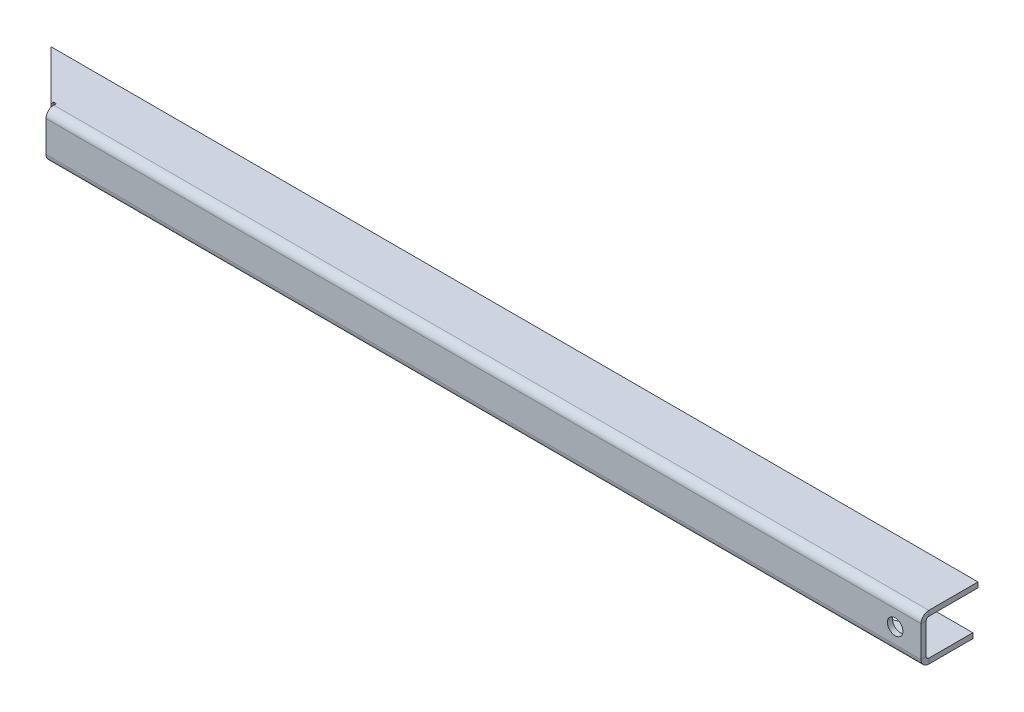
ISO-10303-21;
HEADER;
FILE_DESCRIPTION(('STEP AP214'),'2;1');
FILE_NAME('part.step','',(''),(''),'','','');
FILE_SCHEMA(('AUTOMOTIVE_DESIGN { 1 0 10303 214 1 1 1 1 }'));
ENDSEC;
DATA;
#1=APPLICATION_CONTEXT('core data for automotive mechanical design processes');
#2=APPLICATION_PROTOCOL_DEFINITION('international standard','automotive_design',2000,#1);
#3=PRODUCT_CONTEXT('',#1,'mechanical');
#4=PRODUCT('Part','Part','',(#3));
#5=PRODUCT_RELATED_PRODUCT_CATEGORY('part','',(#4));
#6=PRODUCT_DEFINITION_FORMATION('','',#4);
#7=PRODUCT_DEFINITION_CONTEXT('part definition',#1,'design');
#8=PRODUCT_DEFINITION('design','',#6,#7);
#9=PRODUCT_DEFINITION_SHAPE('','',#8);
#10=(LENGTH_UNIT() NAMED_UNIT(*) SI_UNIT(.MILLI.,.METRE.));
#11=(NAMED_UNIT(*) PLANE_ANGLE_UNIT() SI_UNIT($,.RADIAN.));
#12=(NAMED_UNIT(*) SI_UNIT($,.STERADIAN.) SOLID_ANGLE_UNIT());
#13=UNCERTAINTY_MEASURE_WITH_UNIT(LENGTH_MEASURE(1.E-05),#10,'distance_accuracy_value','');
#14=(GEOMETRIC_REPRESENTATION_CONTEXT(3) GLOBAL_UNCERTAINTY_ASSIGNED_CONTEXT((#13)) GLOBAL_UNIT_ASSIGNED_CONTEXT((#10,
#11,#12)) REPRESENTATION_CONTEXT('',''));
#15=CARTESIAN_POINT('',(0.,0.,0.));
#16=DIRECTION('',(0.,0.,1.));
#17=DIRECTION('',(1.,0.,0.));
#18=AXIS2_PLACEMENT_3D('',#15,#16,#17);
#19=CARTESIAN_POINT('',(-84.5,-8.,1.00000000000002));
#20=DIRECTION('',(1.,0.,0.));
#21=DIRECTION('',(0.,0.,-1.));
#22=AXIS2_PLACEMENT_3D('',#19,#20,#21);
#23=PLANE('',#22);
#24=DIRECTION('',(0.,0.,1.));
#25=VECTOR('',#24,1.);
#26=CARTESIAN_POINT('',(-84.5,-7.50000000000001,0.));
#27=LINE('',#26,#25);
#28=CARTESIAN_POINT('',(-84.5,-7.50000000000001,0.));
#29=VERTEX_POINT('',#28);
#30=CARTESIAN_POINT('',(-84.5,-7.5,1.00000000000003));
#31=VERTEX_POINT('',#30);
#32=EDGE_CURVE('E208',#29,#31,#27,.T.);
#33=ORIENTED_EDGE('',*,*,#32,.T.);
#34=DIRECTION('',(0.,-1.,0.));
#35=VECTOR('',#34,1.);
#36=CARTESIAN_POINT('',(-84.5,-8.,1.00000000000002));
#37=LINE('',#36,#35);
#38=CARTESIAN_POINT('',(-84.5,-1.50000000000001,0.999999999999986));
#39=VERTEX_POINT('',#38);
#40=EDGE_CURVE('E231',#39,#31,#37,.T.);
#41=ORIENTED_EDGE('',*,*,#40,.F.);
#42=DIRECTION('',(0.,0.,1.));
#43=VECTOR('',#42,1.);
#44=CARTESIAN_POINT('',(-84.5,-1.50000000000001,0.));
#45=LINE('',#44,#43);
#46=CARTESIAN_POINT('',(-84.5,-1.5,0.));
#47=VERTEX_POINT('',#46);
#48=EDGE_CURVE('E222',#47,#39,#45,.T.);
#49=ORIENTED_EDGE('',*,*,#48,.F.);
#50=DIRECTION('',(0.,-1.,0.));
#51=VECTOR('',#50,1.);
#52=CARTESIAN_POINT('',(-84.5,-8.,0.));
#53=LINE('',#52,#51);
#54=EDGE_CURVE('E230',#47,#29,#53,.T.);
#55=ORIENTED_EDGE('',*,*,#54,.T.);
#56=EDGE_LOOP('',(#33,#41,#49,#55));
#57=FACE_BOUND('',#56,.T.);
#58=ADVANCED_FACE('F43',(#57),#23,.F.);
#59=CARTESIAN_POINT('',(84.5,-0.999999999999997,0.999999999999969));
#60=DIRECTION('',(-1.,0.,0.));
#61=DIRECTION('',(0.,0.,1.));
#62=AXIS2_PLACEMENT_3D('',#59,#60,#61);
#63=PLANE('',#62);
#64=DIRECTION('',(0.,0.,1.));
#65=VECTOR('',#64,1.);
#66=CARTESIAN_POINT('',(84.5,-7.50000000000001,0.));
#67=LINE('',#66,#65);
#68=CARTESIAN_POINT('',(84.5,-7.50000000000001,0.));
#69=VERTEX_POINT('',#68);
#70=CARTESIAN_POINT('',(84.5,-7.50000000000001,0.999999999999993));
#71=VERTEX_POINT('',#70);
#72=EDGE_CURVE('E214',#69,#71,#67,.T.);
#73=ORIENTED_EDGE('',*,*,#72,.F.);
#74=DIRECTION('',(0.,1.,0.));
#75=VECTOR('',#74,1.);
#76=CARTESIAN_POINT('',(84.5,-1.,0.));
#77=LINE('',#76,#75);
#78=CARTESIAN_POINT('',(84.5,-1.5,0.));
#79=VERTEX_POINT('',#78);
#80=EDGE_CURVE('E234',#69,#79,#77,.T.);
#81=ORIENTED_EDGE('',*,*,#80,.T.);
#82=DIRECTION('',(0.,0.,1.));
#83=VECTOR('',#82,1.);
#84=CARTESIAN_POINT('',(84.5,-1.5,0.));
#85=LINE('',#84,#83);
#86=CARTESIAN_POINT('',(84.5,-1.5,0.999999999999971));
#87=VERTEX_POINT('',#86);
#88=EDGE_CURVE('E217',#79,#87,#85,.T.);
#89=ORIENTED_EDGE('',*,*,#88,.T.);
#90=DIRECTION('',(0.,1.,0.));
#91=VECTOR('',#90,1.);
#92=CARTESIAN_POINT('',(84.5,-0.999999999999997,0.999999999999969));
#93=LINE('',#92,#91);
#94=EDGE_CURVE('E233',#71,#87,#93,.T.);
#95=ORIENTED_EDGE('',*,*,#94,.F.);
#96=EDGE_LOOP('',(#73,#81,#89,#95));
#97=FACE_BOUND('',#96,.T.);
#98=ADVANCED_FACE('F348',(#97),#63,.F.);
#99=CARTESIAN_POINT('',(0.,0.,0.999999999999981));
#100=DIRECTION('',(0.,0.,-1.));
#101=DIRECTION('',(0.,1.,0.));
#102=AXIS2_PLACEMENT_3D('',#99,#100,#101);
#103=PLANE('',#102);
#104=CARTESIAN_POINT('',(79.5,-4.49999999999996,0.999999999999982));
#105=DIRECTION('',(0.,0.,-1.));
#106=DIRECTION('',(0.,1.,0.));
#107=AXIS2_PLACEMENT_3D('',#104,#105,#106);
#108=CIRCLE('',#107,1.5);
#109=CARTESIAN_POINT('',(79.5,-2.99999999999996,0.999999999999977));
#110=VERTEX_POINT('',#109);
#111=EDGE_CURVE('E320',#110,#110,#108,.T.);
#112=ORIENTED_EDGE('',*,*,#111,.T.);
#113=EDGE_LOOP('',(#112));
#114=FACE_BOUND('',#113,.T.);
#115=DIRECTION('',(-1.,0.,0.));
#116=VECTOR('',#115,1.);
#117=CARTESIAN_POINT('',(-84.5,-7.5,1.00000000000003));
#118=LINE('',#117,#116);
#119=EDGE_CURVE('E161',#31,#71,#118,.F.);
#120=ORIENTED_EDGE('',*,*,#119,.T.);
#121=ORIENTED_EDGE('',*,*,#94,.T.);
#122=DIRECTION('',(1.,0.,0.));
#123=VECTOR('',#122,1.);
#124=CARTESIAN_POINT('',(0.,-1.5,0.999999999999986));
#125=LINE('',#124,#123);
#126=EDGE_CURVE('E225',#39,#87,#125,.T.);
#127=ORIENTED_EDGE('',*,*,#126,.F.);
#128=ORIENTED_EDGE('',*,*,#40,.T.);
#129=EDGE_LOOP('',(#120,#121,#127,#128));
#130=FACE_BOUND('',#129,.T.);
#131=ADVANCED_FACE('F336',(#114,#130),#103,.F.);
#132=CARTESIAN_POINT('',(0.,0.,0.));
#133=DIRECTION('',(0.,0.,-1.));
#134=DIRECTION('',(0.,1.,0.));
#135=AXIS2_PLACEMENT_3D('',#132,#133,#134);
#136=PLANE('',#135);
#137=CARTESIAN_POINT('',(79.5,-4.49999999999997,0.));
#138=DIRECTION('',(0.,0.,-1.));
#139=DIRECTION('',(0.,1.,0.));
#140=AXIS2_PLACEMENT_3D('',#137,#138,#139);
#141=CIRCLE('',#140,1.5);
#142=CARTESIAN_POINT('',(79.5,-2.99999999999997,0.));
#143=VERTEX_POINT('',#142);
#144=EDGE_CURVE('E327',#143,#143,#141,.T.);
#145=ORIENTED_EDGE('',*,*,#144,.F.);
#146=EDGE_LOOP('',(#145));
#147=FACE_BOUND('',#146,.T.);
#148=ORIENTED_EDGE('',*,*,#80,.F.);
#149=DIRECTION('',(-1.,0.,0.));
#150=VECTOR('',#149,1.);
#151=CARTESIAN_POINT('',(-84.5,-7.50000000000001,0.));
#152=LINE('',#151,#150);
#153=EDGE_CURVE('E60',#29,#69,#152,.F.);
#154=ORIENTED_EDGE('',*,*,#153,.F.);
#155=ORIENTED_EDGE('',*,*,#54,.F.);
#156=DIRECTION('',(-1.,0.,0.));
#157=VECTOR('',#156,1.);
#158=CARTESIAN_POINT('',(84.5,-1.5,0.));
#159=LINE('',#158,#157);
#160=EDGE_CURVE('E220',#79,#47,#159,.T.);
#161=ORIENTED_EDGE('',*,*,#160,.F.);
#162=EDGE_LOOP('',(#148,#154,#155,#161));
#163=FACE_BOUND('',#162,.T.);
#164=ADVANCED_FACE('F334',(#147,#163),#136,.T.);
#165=CARTESIAN_POINT('',(-84.5,-1.,0.));
#166=DIRECTION('',(-0.707106781186544,0.,0.707106781186551));
#167=DIRECTION('',(0.707106781186551,0.,0.707106781186544));
#168=AXIS2_PLACEMENT_3D('',#165,#166,#167);
#169=PLANE('',#168);
#170=DIRECTION('',(0.707106781186551,0.,0.707106781186544));
#171=VECTOR('',#170,1.);
#172=CARTESIAN_POINT('',(-84.5,-1.,0.));
#173=LINE('',#172,#171);
#174=CARTESIAN_POINT('',(-94.5000000000001,-1.,-10.));
#175=VERTEX_POINT('',#174);
#176=CARTESIAN_POINT('',(-85.,-1.,-0.499999999999995));
#177=VERTEX_POINT('',#176);
#178=EDGE_CURVE('E276',#175,#177,#173,.T.);
#179=ORIENTED_EDGE('',*,*,#178,.T.);
#180=DIRECTION('',(0.,1.,0.));
#181=VECTOR('',#180,1.);
#182=CARTESIAN_POINT('',(-85.,-1.,-0.499999999999995));
#183=LINE('',#182,#181);
#184=CARTESIAN_POINT('',(-85.,0.,-0.499999999999995));
#185=VERTEX_POINT('',#184);
#186=EDGE_CURVE('E265',#177,#185,#183,.T.);
#187=ORIENTED_EDGE('',*,*,#186,.T.);
#188=DIRECTION('',(0.707106781186551,0.,0.707106781186544));
#189=VECTOR('',#188,1.);
#190=CARTESIAN_POINT('',(-84.5,0.,0.));
#191=LINE('',#190,#189);
#192=CARTESIAN_POINT('',(-94.5000000000001,0.,-10.));
#193=VERTEX_POINT('',#192);
#194=EDGE_CURVE('E264',#193,#185,#191,.T.);
#195=ORIENTED_EDGE('',*,*,#194,.F.);
#196=DIRECTION('',(0.,1.,0.));
#197=VECTOR('',#196,1.);
#198=CARTESIAN_POINT('',(-94.5000000000001,-1.,-10.));
#199=LINE('',#198,#197);
#200=EDGE_CURVE('E292',#175,#193,#199,.T.);
#201=ORIENTED_EDGE('',*,*,#200,.F.);
#202=EDGE_LOOP('',(#179,#187,#195,#201));
#203=FACE_BOUND('',#202,.T.);
#204=ADVANCED_FACE('F45',(#203),#169,.T.);
#205=CARTESIAN_POINT('',(0.,-1.,0.));
#206=DIRECTION('',(0.,-1.,0.));
#207=DIRECTION('',(0.,0.,-1.));
#208=AXIS2_PLACEMENT_3D('',#205,#206,#207);
#209=PLANE('',#208);
#210=DIRECTION('',(1.,0.,0.));
#211=VECTOR('',#210,1.);
#212=CARTESIAN_POINT('',(-85.,-1.,-0.999999999999998));
#213=LINE('',#212,#211);
#214=CARTESIAN_POINT('',(-85.,-1.,-0.999999999999998));
#215=VERTEX_POINT('',#214);
#216=CARTESIAN_POINT('',(-84.5,-1.,-0.999999999999998));
#217=VERTEX_POINT('',#216);
#218=EDGE_CURVE('E68',#215,#217,#213,.T.);
#219=ORIENTED_EDGE('',*,*,#218,.F.);
#220=DIRECTION('',(0.,0.,-1.));
#221=VECTOR('',#220,1.);
#222=CARTESIAN_POINT('',(-85.,-1.,-0.499999999999995));
#223=LINE('',#222,#221);
#224=EDGE_CURVE('E261',#177,#215,#223,.T.);
#225=ORIENTED_EDGE('',*,*,#224,.F.);
#226=ORIENTED_EDGE('',*,*,#178,.F.);
#227=DIRECTION('',(-1.,0.,0.));
#228=VECTOR('',#227,1.);
#229=CARTESIAN_POINT('',(-94.5000000000001,-1.,-10.));
#230=LINE('',#229,#228);
#231=CARTESIAN_POINT('',(84.5,-1.,-10.));
#232=VERTEX_POINT('',#231);
#233=EDGE_CURVE('E282',#232,#175,#230,.T.);
#234=ORIENTED_EDGE('',*,*,#233,.F.);
#235=DIRECTION('',(0.,0.,-1.));
#236=VECTOR('',#235,1.);
#237=CARTESIAN_POINT('',(84.5,-1.,0.));
#238=LINE('',#237,#236);
#239=CARTESIAN_POINT('',(84.5,-1.,-0.500000000000035));
#240=VERTEX_POINT('',#239);
#241=EDGE_CURVE('E279',#240,#232,#238,.T.);
#242=ORIENTED_EDGE('',*,*,#241,.F.);
#243=DIRECTION('',(-1.,0.,0.));
#244=VECTOR('',#243,1.);
#245=CARTESIAN_POINT('',(-84.5,-1.,-0.499999999999998));
#246=LINE('',#245,#244);
#247=CARTESIAN_POINT('',(-84.5,-1.,-0.499999999999998));
#248=VERTEX_POINT('',#247);
#249=EDGE_CURVE('E251',#248,#240,#246,.F.);
#250=ORIENTED_EDGE('',*,*,#249,.F.);
#251=DIRECTION('',(0.,0.,1.));
#252=VECTOR('',#251,1.);
#253=CARTESIAN_POINT('',(-84.5,-1.,-0.999999999999998));
#254=LINE('',#253,#252);
#255=EDGE_CURVE('E268',#217,#248,#254,.T.);
#256=ORIENTED_EDGE('',*,*,#255,.F.);
#257=EDGE_LOOP('',(#219,#225,#226,#234,#242,#250,#256));
#258=FACE_BOUND('',#257,.T.);
#259=ADVANCED_FACE('F365',(#258),#209,.T.);
#260=CARTESIAN_POINT('',(0.,0.,0.));
#261=DIRECTION('',(0.,-1.,0.));
#262=DIRECTION('',(0.,0.,-1.));
#263=AXIS2_PLACEMENT_3D('',#260,#261,#262);
#264=PLANE('',#263);
#265=DIRECTION('',(0.,0.,1.));
#266=VECTOR('',#265,1.);
#267=CARTESIAN_POINT('',(-85.,0.,0.));
#268=LINE('',#267,#266);
#269=CARTESIAN_POINT('',(-85.,0.,-0.999999999999998));
#270=VERTEX_POINT('',#269);
#271=EDGE_CURVE('E11',#270,#185,#268,.T.);
#272=ORIENTED_EDGE('',*,*,#271,.F.);
#273=DIRECTION('',(-1.,0.,0.));
#274=VECTOR('',#273,1.);
#275=CARTESIAN_POINT('',(0.,0.,-0.999999999999998));
#276=LINE('',#275,#274);
#277=CARTESIAN_POINT('',(-84.5,0.,-0.999999999999998));
#278=VERTEX_POINT('',#277);
#279=EDGE_CURVE('E52',#278,#270,#276,.T.);
#280=ORIENTED_EDGE('',*,*,#279,.F.);
#281=DIRECTION('',(0.,0.,-1.));
#282=VECTOR('',#281,1.);
#283=CARTESIAN_POINT('',(-84.5,0.,0.));
#284=LINE('',#283,#282);
#285=CARTESIAN_POINT('',(-84.5,0.,-0.500000000000004));
#286=VERTEX_POINT('',#285);
#287=EDGE_CURVE('E294',#286,#278,#284,.T.);
#288=ORIENTED_EDGE('',*,*,#287,.F.);
#289=DIRECTION('',(-1.,0.,0.));
#290=VECTOR('',#289,1.);
#291=CARTESIAN_POINT('',(-84.5,0.,-0.500000000000004));
#292=LINE('',#291,#290);
#293=CARTESIAN_POINT('',(84.5,0.,-0.500000000000035));
#294=VERTEX_POINT('',#293);
#295=EDGE_CURVE('E239',#286,#294,#292,.F.);
#296=ORIENTED_EDGE('',*,*,#295,.T.);
#297=DIRECTION('',(0.,0.,-1.));
#298=VECTOR('',#297,1.);
#299=CARTESIAN_POINT('',(84.5,0.,0.));
#300=LINE('',#299,#298);
#301=CARTESIAN_POINT('',(84.5,0.,-10.));
#302=VERTEX_POINT('',#301);
#303=EDGE_CURVE('E288',#294,#302,#300,.T.);
#304=ORIENTED_EDGE('',*,*,#303,.T.);
#305=DIRECTION('',(-1.,0.,0.));
#306=VECTOR('',#305,1.);
#307=CARTESIAN_POINT('',(-94.5000000000001,0.,-10.));
#308=LINE('',#307,#306);
#309=EDGE_CURVE('E280',#302,#193,#308,.T.);
#310=ORIENTED_EDGE('',*,*,#309,.T.);
#311=ORIENTED_EDGE('',*,*,#194,.T.);
#312=EDGE_LOOP('',(#272,#280,#288,#296,#304,#310,#311));
#313=FACE_BOUND('',#312,.T.);
#314=ADVANCED_FACE('F404',(#313),#264,.F.);
#315=CARTESIAN_POINT('',(-94.5000000000001,-1.,-10.));
#316=DIRECTION('',(0.,0.,-1.));
#317=DIRECTION('',(-1.,0.,0.));
#318=AXIS2_PLACEMENT_3D('',#315,#316,#317);
#319=PLANE('',#318);
#320=ORIENTED_EDGE('',*,*,#309,.F.);
#321=DIRECTION('',(0.,1.,0.));
#322=VECTOR('',#321,1.);
#323=CARTESIAN_POINT('',(84.5,-1.,-10.));
#324=LINE('',#323,#322);
#325=EDGE_CURVE('E285',#232,#302,#324,.T.);
#326=ORIENTED_EDGE('',*,*,#325,.F.);
#327=ORIENTED_EDGE('',*,*,#233,.T.);
#328=ORIENTED_EDGE('',*,*,#200,.T.);
#329=EDGE_LOOP('',(#320,#326,#327,#328));
#330=FACE_BOUND('',#329,.T.);
#331=ADVANCED_FACE('F407',(#330),#319,.T.);
#332=CARTESIAN_POINT('',(84.5,-1.,0.));
#333=DIRECTION('',(1.,0.,0.));
#334=DIRECTION('',(0.,0.,-1.));
#335=AXIS2_PLACEMENT_3D('',#332,#333,#334);
#336=PLANE('',#335);
#337=DIRECTION('',(0.,1.,0.));
#338=VECTOR('',#337,1.);
#339=CARTESIAN_POINT('',(84.5,-1.,-0.500000000000035));
#340=LINE('',#339,#338);
#341=EDGE_CURVE('E256',#240,#294,#340,.T.);
#342=ORIENTED_EDGE('',*,*,#341,.F.);
#343=ORIENTED_EDGE('',*,*,#241,.T.);
#344=ORIENTED_EDGE('',*,*,#325,.T.);
#345=ORIENTED_EDGE('',*,*,#303,.F.);
#346=EDGE_LOOP('',(#342,#343,#344,#345));
#347=FACE_BOUND('',#346,.T.);
#348=ADVANCED_FACE('F362',(#347),#336,.T.);
#349=CARTESIAN_POINT('',(-85.,-1.,-0.499999999999995));
#350=DIRECTION('',(1.,0.,0.));
#351=DIRECTION('',(0.,0.,-1.));
#352=AXIS2_PLACEMENT_3D('',#349,#350,#351);
#353=PLANE('',#352);
#354=DIRECTION('',(0.,1.,0.));
#355=VECTOR('',#354,1.);
#356=CARTESIAN_POINT('',(-85.,-1.,-0.999999999999998));
#357=LINE('',#356,#355);
#358=EDGE_CURVE('E267',#215,#270,#357,.T.);
#359=ORIENTED_EDGE('',*,*,#358,.T.);
#360=ORIENTED_EDGE('',*,*,#271,.T.);
#361=ORIENTED_EDGE('',*,*,#186,.F.);
#362=ORIENTED_EDGE('',*,*,#224,.T.);
#363=EDGE_LOOP('',(#359,#360,#361,#362));
#364=FACE_BOUND('',#363,.T.);
#365=ADVANCED_FACE('F397',(#364),#353,.T.);
#366=CARTESIAN_POINT('',(-85.,-1.,-0.999999999999998));
#367=DIRECTION('',(0.,0.,1.));
#368=DIRECTION('',(0.,-1.,0.));
#369=AXIS2_PLACEMENT_3D('',#366,#367,#368);
#370=PLANE('',#369);
#371=DIRECTION('',(0.,1.,0.));
#372=VECTOR('',#371,1.);
#373=CARTESIAN_POINT('',(-84.5,-1.,-0.999999999999998));
#374=LINE('',#373,#372);
#375=EDGE_CURVE('E259',#217,#278,#374,.T.);
#376=ORIENTED_EDGE('',*,*,#375,.T.);
#377=ORIENTED_EDGE('',*,*,#279,.T.);
#378=ORIENTED_EDGE('',*,*,#358,.F.);
#379=ORIENTED_EDGE('',*,*,#218,.T.);
#380=EDGE_LOOP('',(#376,#377,#378,#379));
#381=FACE_BOUND('',#380,.T.);
#382=ADVANCED_FACE('F393',(#381),#370,.T.);
#383=CARTESIAN_POINT('',(-84.5,-1.,-0.999999999999998));
#384=DIRECTION('',(-1.,0.,0.));
#385=DIRECTION('',(0.,0.,1.));
#386=AXIS2_PLACEMENT_3D('',#383,#384,#385);
#387=PLANE('',#386);
#388=DIRECTION('',(0.,1.,0.));
#389=VECTOR('',#388,1.);
#390=CARTESIAN_POINT('',(-84.5,-1.,-0.499999999999998));
#391=LINE('',#390,#389);
#392=EDGE_CURVE('E245',#248,#286,#391,.T.);
#393=ORIENTED_EDGE('',*,*,#392,.T.);
#394=ORIENTED_EDGE('',*,*,#287,.T.);
#395=ORIENTED_EDGE('',*,*,#375,.F.);
#396=ORIENTED_EDGE('',*,*,#255,.T.);
#397=EDGE_LOOP('',(#393,#394,#395,#396));
#398=FACE_BOUND('',#397,.T.);
#399=ADVANCED_FACE('F388',(#398),#387,.T.);
#400=CARTESIAN_POINT('',(84.5,-1.5,-0.500000000000032));
#401=DIRECTION('',(1.,0.,0.));
#402=DIRECTION('',(0.,0.,-1.));
#403=AXIS2_PLACEMENT_3D('',#400,#401,#402);
#404=PLANE('',#403);
#405=ORIENTED_EDGE('',*,*,#88,.F.);
#406=CARTESIAN_POINT('',(84.5,-1.5,-0.500000000000032));
#407=DIRECTION('',(-1.,0.,0.));
#408=DIRECTION('',(0.,0.,1.));
#409=AXIS2_PLACEMENT_3D('',#406,#407,#408);
#410=CIRCLE('',#409,0.500000000000003);
#411=EDGE_CURVE('E248',#240,#79,#410,.F.);
#412=ORIENTED_EDGE('',*,*,#411,.F.);
#413=ORIENTED_EDGE('',*,*,#341,.T.);
#414=CARTESIAN_POINT('',(84.5,-1.5,-0.500000000000032));
#415=DIRECTION('',(-1.,0.,0.));
#416=DIRECTION('',(0.,0.,1.));
#417=AXIS2_PLACEMENT_3D('',#414,#415,#416);
#418=CIRCLE('',#417,1.5);
#419=EDGE_CURVE('E241',#294,#87,#418,.F.);
#420=ORIENTED_EDGE('',*,*,#419,.T.);
#421=EDGE_LOOP('',(#405,#412,#413,#420));
#422=FACE_BOUND('',#421,.T.);
#423=ADVANCED_FACE('F357',(#422),#404,.T.);
#424=CARTESIAN_POINT('',(-84.5,-1.5,-0.499999999999995));
#425=DIRECTION('',(1.,0.,0.));
#426=DIRECTION('',(0.,0.,-1.));
#427=AXIS2_PLACEMENT_3D('',#424,#425,#426);
#428=PLANE('',#427);
#429=CARTESIAN_POINT('',(-84.5,-1.5,-0.499999999999995));
#430=DIRECTION('',(-1.,0.,0.));
#431=DIRECTION('',(0.,0.,1.));
#432=AXIS2_PLACEMENT_3D('',#429,#430,#431);
#433=CIRCLE('',#432,0.500000000000003);
#434=EDGE_CURVE('E236',#47,#248,#433,.T.);
#435=ORIENTED_EDGE('',*,*,#434,.F.);
#436=ORIENTED_EDGE('',*,*,#48,.T.);
#437=CARTESIAN_POINT('',(-84.5,-1.5,-0.499999999999995));
#438=DIRECTION('',(-1.,0.,0.));
#439=DIRECTION('',(0.,0.,1.));
#440=AXIS2_PLACEMENT_3D('',#437,#438,#439);
#441=CIRCLE('',#440,1.5);
#442=EDGE_CURVE('E242',#39,#286,#441,.T.);
#443=ORIENTED_EDGE('',*,*,#442,.T.);
#444=ORIENTED_EDGE('',*,*,#392,.F.);
#445=EDGE_LOOP('',(#435,#436,#443,#444));
#446=FACE_BOUND('',#445,.T.);
#447=ADVANCED_FACE('F373',(#446),#428,.F.);
#448=CARTESIAN_POINT('',(-84.5,-1.5,-0.499999999999995));
#449=DIRECTION('',(-1.,0.,0.));
#450=DIRECTION('',(0.,0.,1.));
#451=AXIS2_PLACEMENT_3D('',#448,#449,#450);
#452=CYLINDRICAL_SURFACE('',#451,1.5);
#453=ORIENTED_EDGE('',*,*,#295,.F.);
#454=ORIENTED_EDGE('',*,*,#442,.F.);
#455=ORIENTED_EDGE('',*,*,#126,.T.);
#456=ORIENTED_EDGE('',*,*,#419,.F.);
#457=EDGE_LOOP('',(#453,#454,#455,#456));
#458=FACE_BOUND('',#457,.T.);
#459=ADVANCED_FACE('F355',(#458),#452,.T.);
#460=CARTESIAN_POINT('',(-84.5,-1.5,-0.499999999999995));
#461=DIRECTION('',(-1.,0.,0.));
#462=DIRECTION('',(0.,0.,1.));
#463=AXIS2_PLACEMENT_3D('',#460,#461,#462);
#464=CYLINDRICAL_SURFACE('',#463,0.500000000000003);
#465=ORIENTED_EDGE('',*,*,#249,.T.);
#466=ORIENTED_EDGE('',*,*,#411,.T.);
#467=ORIENTED_EDGE('',*,*,#160,.T.);
#468=ORIENTED_EDGE('',*,*,#434,.T.);
#469=EDGE_LOOP('',(#465,#466,#467,#468));
#470=FACE_BOUND('',#469,.T.);
#471=ADVANCED_FACE('F368',(#470),#464,.F.);
#472=CARTESIAN_POINT('',(84.5,-7.50000000000001,-0.500000000000012));
#473=DIRECTION('',(1.,0.,0.));
#474=DIRECTION('',(0.,0.,-1.));
#475=AXIS2_PLACEMENT_3D('',#472,#473,#474);
#476=PLANE('',#475);
#477=DIRECTION('',(0.,-1.,0.));
#478=VECTOR('',#477,1.);
#479=CARTESIAN_POINT('',(84.5,-8.00000000000001,-0.500000000000006));
#480=LINE('',#479,#478);
#481=CARTESIAN_POINT('',(84.5,-8.00000000000001,-0.500000000000008));
#482=VERTEX_POINT('',#481);
#483=CARTESIAN_POINT('',(84.5,-9.00000000000001,-0.500000000000001));
#484=VERTEX_POINT('',#483);
#485=EDGE_CURVE('E309',#482,#484,#480,.T.);
#486=ORIENTED_EDGE('',*,*,#485,.F.);
#487=CARTESIAN_POINT('',(84.5,-7.50000000000001,-0.500000000000012));
#488=DIRECTION('',(-1.,0.,0.));
#489=DIRECTION('',(0.,0.,1.));
#490=AXIS2_PLACEMENT_3D('',#487,#488,#489);
#491=CIRCLE('',#490,0.5);
#492=EDGE_CURVE('E164',#69,#482,#491,.F.);
#493=ORIENTED_EDGE('',*,*,#492,.F.);
#494=ORIENTED_EDGE('',*,*,#72,.T.);
#495=CARTESIAN_POINT('',(84.5,-7.50000000000001,-0.500000000000012));
#496=DIRECTION('',(-1.,0.,0.));
#497=DIRECTION('',(0.,0.,1.));
#498=AXIS2_PLACEMENT_3D('',#495,#496,#497);
#499=CIRCLE('',#498,1.5);
#500=EDGE_CURVE('E207',#71,#484,#499,.F.);
#501=ORIENTED_EDGE('',*,*,#500,.T.);
#502=EDGE_LOOP('',(#486,#493,#494,#501));
#503=FACE_BOUND('',#502,.T.);
#504=ADVANCED_FACE('F346',(#503),#476,.T.);
#505=CARTESIAN_POINT('',(-84.5,-7.50000000000001,-0.499999999999975));
#506=DIRECTION('',(1.,0.,0.));
#507=DIRECTION('',(0.,0.,-1.));
#508=AXIS2_PLACEMENT_3D('',#505,#506,#507);
#509=PLANE('',#508);
#510=CARTESIAN_POINT('',(-84.5,-7.50000000000001,-0.499999999999975));
#511=DIRECTION('',(-1.,0.,0.));
#512=DIRECTION('',(0.,0.,1.));
#513=AXIS2_PLACEMENT_3D('',#510,#511,#512);
#514=CIRCLE('',#513,0.5);
#515=CARTESIAN_POINT('',(-84.5,-8.00000000000001,-0.499999999999972));
#516=VERTEX_POINT('',#515);
#517=EDGE_CURVE('E171',#516,#29,#514,.T.);
#518=ORIENTED_EDGE('',*,*,#517,.F.);
#519=DIRECTION('',(0.,-1.,0.));
#520=VECTOR('',#519,1.);
#521=CARTESIAN_POINT('',(-84.5,-8.00000000000001,-0.499999999999974));
#522=LINE('',#521,#520);
#523=CARTESIAN_POINT('',(-84.5,-9.00000000000001,-0.499999999999967));
#524=VERTEX_POINT('',#523);
#525=EDGE_CURVE('E168',#516,#524,#522,.T.);
#526=ORIENTED_EDGE('',*,*,#525,.T.);
#527=CARTESIAN_POINT('',(-84.5,-7.50000000000001,-0.499999999999975));
#528=DIRECTION('',(-1.,0.,0.));
#529=DIRECTION('',(0.,0.,1.));
#530=AXIS2_PLACEMENT_3D('',#527,#528,#529);
#531=CIRCLE('',#530,1.5);
#532=EDGE_CURVE('E154',#524,#31,#531,.T.);
#533=ORIENTED_EDGE('',*,*,#532,.T.);
#534=ORIENTED_EDGE('',*,*,#32,.F.);
#535=EDGE_LOOP('',(#518,#526,#533,#534));
#536=FACE_BOUND('',#535,.T.);
#537=ADVANCED_FACE('F169',(#536),#509,.F.);
#538=CARTESIAN_POINT('',(-84.5,-7.50000000000001,-0.499999999999975));
#539=DIRECTION('',(-1.,0.,0.));
#540=DIRECTION('',(0.,-1.,0.));
#541=AXIS2_PLACEMENT_3D('',#538,#539,#540);
#542=CYLINDRICAL_SURFACE('',#541,1.5);
#543=ORIENTED_EDGE('',*,*,#119,.F.);
#544=ORIENTED_EDGE('',*,*,#532,.F.);
#545=DIRECTION('',(1.,0.,0.));
#546=VECTOR('',#545,1.);
#547=CARTESIAN_POINT('',(0.,-9.00000000000001,-0.499999999999983));
#548=LINE('',#547,#546);
#549=EDGE_CURVE('E159',#524,#484,#548,.T.);
#550=ORIENTED_EDGE('',*,*,#549,.T.);
#551=ORIENTED_EDGE('',*,*,#500,.F.);
#552=EDGE_LOOP('',(#543,#544,#550,#551));
#553=FACE_BOUND('',#552,.T.);
#554=ADVANCED_FACE('F156',(#553),#542,.T.);
#555=CARTESIAN_POINT('',(-84.5,-7.50000000000001,-0.499999999999975));
#556=DIRECTION('',(-1.,0.,0.));
#557=DIRECTION('',(0.,-1.,0.));
#558=AXIS2_PLACEMENT_3D('',#555,#556,#557);
#559=CYLINDRICAL_SURFACE('',#558,0.5);
#560=ORIENTED_EDGE('',*,*,#153,.T.);
#561=ORIENTED_EDGE('',*,*,#492,.T.);
#562=DIRECTION('',(-1.,0.,0.));
#563=VECTOR('',#562,1.);
#564=CARTESIAN_POINT('',(84.5,-8.00000000000001,-0.500000000000006));
#565=LINE('',#564,#563);
#566=EDGE_CURVE('E175',#482,#516,#565,.T.);
#567=ORIENTED_EDGE('',*,*,#566,.T.);
#568=ORIENTED_EDGE('',*,*,#517,.T.);
#569=EDGE_LOOP('',(#560,#561,#567,#568));
#570=FACE_BOUND('',#569,.T.);
#571=ADVANCED_FACE('F343',(#570),#559,.F.);
#572=CARTESIAN_POINT('',(-84.5,-9.00000000000007,-8.99999999999997));
#573=DIRECTION('',(1.,0.,0.));
#574=DIRECTION('',(0.,0.,-1.));
#575=AXIS2_PLACEMENT_3D('',#572,#573,#574);
#576=PLANE('',#575);
#577=ORIENTED_EDGE('',*,*,#525,.F.);
#578=DIRECTION('',(0.,0.,-1.));
#579=VECTOR('',#578,1.);
#580=CARTESIAN_POINT('',(-84.5,-8.00000000000007,-8.99999999999998));
#581=LINE('',#580,#579);
#582=CARTESIAN_POINT('',(-84.5,-8.00000000000007,-8.99999999999998));
#583=VERTEX_POINT('',#582);
#584=EDGE_CURVE('E184',#516,#583,#581,.T.);
#585=ORIENTED_EDGE('',*,*,#584,.T.);
#586=DIRECTION('',(0.,1.,0.));
#587=VECTOR('',#586,1.);
#588=CARTESIAN_POINT('',(-84.5,-9.00000000000007,-8.99999999999997));
#589=LINE('',#588,#587);
#590=CARTESIAN_POINT('',(-84.5,-9.00000000000007,-8.99999999999997));
#591=VERTEX_POINT('',#590);
#592=EDGE_CURVE('E188',#591,#583,#589,.T.);
#593=ORIENTED_EDGE('',*,*,#592,.F.);
#594=DIRECTION('',(0.,0.,-1.));
#595=VECTOR('',#594,1.);
#596=CARTESIAN_POINT('',(-84.5,-9.00000000000007,-8.99999999999997));
#597=LINE('',#596,#595);
#598=EDGE_CURVE('E180',#524,#591,#597,.T.);
#599=ORIENTED_EDGE('',*,*,#598,.F.);
#600=EDGE_LOOP('',(#577,#585,#593,#599));
#601=FACE_BOUND('',#600,.T.);
#602=ADVANCED_FACE('F186',(#601),#576,.F.);
#603=CARTESIAN_POINT('',(84.5,-9.00000000000001,0.));
#604=DIRECTION('',(-1.,0.,0.));
#605=DIRECTION('',(0.,-1.,0.));
#606=AXIS2_PLACEMENT_3D('',#603,#604,#605);
#607=PLANE('',#606);
#608=ORIENTED_EDGE('',*,*,#485,.T.);
#609=DIRECTION('',(0.,0.,1.));
#610=VECTOR('',#609,1.);
#611=CARTESIAN_POINT('',(84.5,-9.00000000000001,0.));
#612=LINE('',#611,#610);
#613=CARTESIAN_POINT('',(84.5,-9.00000000000007,-9.00000000000001));
#614=VERTEX_POINT('',#613);
#615=EDGE_CURVE('E183',#614,#484,#612,.T.);
#616=ORIENTED_EDGE('',*,*,#615,.F.);
#617=DIRECTION('',(0.,1.,0.));
#618=VECTOR('',#617,1.);
#619=CARTESIAN_POINT('',(84.5,-9.00000000000007,-9.00000000000001));
#620=LINE('',#619,#618);
#621=CARTESIAN_POINT('',(84.5,-8.00000000000007,-9.00000000000001));
#622=VERTEX_POINT('',#621);
#623=EDGE_CURVE('E200',#614,#622,#620,.T.);
#624=ORIENTED_EDGE('',*,*,#623,.T.);
#625=DIRECTION('',(0.,0.,1.));
#626=VECTOR('',#625,1.);
#627=CARTESIAN_POINT('',(84.5,-8.,0.));
#628=LINE('',#627,#626);
#629=EDGE_CURVE('E191',#622,#482,#628,.T.);
#630=ORIENTED_EDGE('',*,*,#629,.T.);
#631=EDGE_LOOP('',(#608,#616,#624,#630));
#632=FACE_BOUND('',#631,.T.);
#633=ADVANCED_FACE('F476',(#632),#607,.F.);
#634=CARTESIAN_POINT('',(0.,-9.00000000000001,0.));
#635=DIRECTION('',(0.,1.,0.));
#636=DIRECTION('',(0.,0.,1.));
#637=AXIS2_PLACEMENT_3D('',#634,#635,#636);
#638=PLANE('',#637);
#639=CARTESIAN_POINT('',(-74.5,-9.00000000000004,-4.99999999999997));
#640=DIRECTION('',(0.,-1.,0.));
#641=DIRECTION('',(0.,0.,-1.));
#642=AXIS2_PLACEMENT_3D('',#639,#640,#641);
#643=CIRCLE('',#642,1.5);
#644=CARTESIAN_POINT('',(-74.5,-9.00000000000005,-6.49999999999997));
#645=VERTEX_POINT('',#644);
#646=EDGE_CURVE('E304',#645,#645,#643,.T.);
#647=ORIENTED_EDGE('',*,*,#646,.F.);
#648=EDGE_LOOP('',(#647));
#649=FACE_BOUND('',#648,.T.);
#650=CARTESIAN_POINT('',(0.,-9.00000000000004,-4.99999999999997));
#651=DIRECTION('',(0.,-1.,0.));
#652=DIRECTION('',(0.,0.,-1.));
#653=AXIS2_PLACEMENT_3D('',#650,#651,#652);
#654=CIRCLE('',#653,1.5);
#655=CARTESIAN_POINT('',(0.,-9.00000000000005,-6.49999999999998));
#656=VERTEX_POINT('',#655);
#657=EDGE_CURVE('E319',#656,#656,#654,.T.);
#658=ORIENTED_EDGE('',*,*,#657,.F.);
#659=EDGE_LOOP('',(#658));
#660=FACE_BOUND('',#659,.T.);
#661=CARTESIAN_POINT('',(74.5000000000001,-9.00000000000004,-4.99999999999997));
#662=DIRECTION('',(0.,-1.,0.));
#663=DIRECTION('',(0.,0.,-1.));
#664=AXIS2_PLACEMENT_3D('',#661,#662,#663);
#665=CIRCLE('',#664,1.5);
#666=CARTESIAN_POINT('',(74.5000000000001,-9.00000000000005,-6.49999999999997));
#667=VERTEX_POINT('',#666);
#668=EDGE_CURVE('E316',#667,#667,#665,.T.);
#669=ORIENTED_EDGE('',*,*,#668,.F.);
#670=EDGE_LOOP('',(#669));
#671=FACE_BOUND('',#670,.T.);
#672=ORIENTED_EDGE('',*,*,#549,.F.);
#673=ORIENTED_EDGE('',*,*,#598,.T.);
#674=DIRECTION('',(1.,0.,0.));
#675=VECTOR('',#674,1.);
#676=CARTESIAN_POINT('',(84.5,-9.00000000000007,-9.00000000000001));
#677=LINE('',#676,#675);
#678=EDGE_CURVE('E190',#591,#614,#677,.T.);
#679=ORIENTED_EDGE('',*,*,#678,.T.);
#680=ORIENTED_EDGE('',*,*,#615,.T.);
#681=EDGE_LOOP('',(#672,#673,#679,#680));
#682=FACE_BOUND('',#681,.T.);
#683=ADVANCED_FACE('F179',(#649,#660,#671,#682),#638,.F.);
#684=CARTESIAN_POINT('',(0.,-8.,0.));
#685=DIRECTION('',(0.,1.,0.));
#686=DIRECTION('',(0.,0.,1.));
#687=AXIS2_PLACEMENT_3D('',#684,#685,#686);
#688=PLANE('',#687);
#689=CARTESIAN_POINT('',(-74.5,-8.00000000000004,-4.99999999999998));
#690=DIRECTION('',(0.,1.,0.));
#691=DIRECTION('',(0.,0.,1.));
#692=AXIS2_PLACEMENT_3D('',#689,#690,#691);
#693=CIRCLE('',#692,1.5);
#694=CARTESIAN_POINT('',(-74.5,-8.00000000000003,-3.49999999999998));
#695=VERTEX_POINT('',#694);
#696=EDGE_CURVE('E47',#695,#695,#693,.T.);
#697=ORIENTED_EDGE('',*,*,#696,.F.);
#698=EDGE_LOOP('',(#697));
#699=FACE_BOUND('',#698,.T.);
#700=CARTESIAN_POINT('',(0.,-8.00000000000004,-4.99999999999998));
#701=DIRECTION('',(0.,1.,0.));
#702=DIRECTION('',(0.,0.,1.));
#703=AXIS2_PLACEMENT_3D('',#700,#701,#702);
#704=CIRCLE('',#703,1.5);
#705=CARTESIAN_POINT('',(0.,-8.00000000000003,-3.49999999999998));
#706=VERTEX_POINT('',#705);
#707=EDGE_CURVE('E303',#706,#706,#704,.T.);
#708=ORIENTED_EDGE('',*,*,#707,.F.);
#709=EDGE_LOOP('',(#708));
#710=FACE_BOUND('',#709,.T.);
#711=CARTESIAN_POINT('',(74.5000000000001,-8.00000000000004,-4.99999999999998));
#712=DIRECTION('',(0.,1.,0.));
#713=DIRECTION('',(0.,0.,1.));
#714=AXIS2_PLACEMENT_3D('',#711,#712,#713);
#715=CIRCLE('',#714,1.5);
#716=CARTESIAN_POINT('',(74.5000000000001,-8.00000000000003,-3.49999999999998));
#717=VERTEX_POINT('',#716);
#718=EDGE_CURVE('E301',#717,#717,#715,.T.);
#719=ORIENTED_EDGE('',*,*,#718,.F.);
#720=EDGE_LOOP('',(#719));
#721=FACE_BOUND('',#720,.T.);
#722=ORIENTED_EDGE('',*,*,#584,.F.);
#723=ORIENTED_EDGE('',*,*,#566,.F.);
#724=ORIENTED_EDGE('',*,*,#629,.F.);
#725=DIRECTION('',(1.,0.,0.));
#726=VECTOR('',#725,1.);
#727=CARTESIAN_POINT('',(84.5,-8.00000000000007,-9.00000000000001));
#728=LINE('',#727,#726);
#729=EDGE_CURVE('E195',#583,#622,#728,.T.);
#730=ORIENTED_EDGE('',*,*,#729,.F.);
#731=EDGE_LOOP('',(#722,#723,#724,#730));
#732=FACE_BOUND('',#731,.T.);
#733=ADVANCED_FACE('F490',(#699,#710,#721,#732),#688,.T.);
#734=CARTESIAN_POINT('',(84.5,-9.00000000000007,-9.00000000000001));
#735=DIRECTION('',(0.,0.,1.));
#736=DIRECTION('',(0.,-1.,0.));
#737=AXIS2_PLACEMENT_3D('',#734,#735,#736);
#738=PLANE('',#737);
#739=ORIENTED_EDGE('',*,*,#729,.T.);
#740=ORIENTED_EDGE('',*,*,#623,.F.);
#741=ORIENTED_EDGE('',*,*,#678,.F.);
#742=ORIENTED_EDGE('',*,*,#592,.T.);
#743=EDGE_LOOP('',(#739,#740,#741,#742));
#744=FACE_BOUND('',#743,.T.);
#745=ADVANCED_FACE('F498',(#744),#738,.F.);
#746=CARTESIAN_POINT('',(74.5000000000001,-6.00000000000004,-4.99999999999999));
#747=DIRECTION('',(0.,-1.,0.));
#748=DIRECTION('',(0.,0.,-1.));
#749=AXIS2_PLACEMENT_3D('',#746,#747,#748);
#750=CYLINDRICAL_SURFACE('',#749,1.5);
#751=ORIENTED_EDGE('',*,*,#718,.T.);
#752=EDGE_LOOP('',(#751));
#753=FACE_BOUND('',#752,.T.);
#754=ORIENTED_EDGE('',*,*,#668,.T.);
#755=EDGE_LOOP('',(#754));
#756=FACE_BOUND('',#755,.T.);
#757=ADVANCED_FACE('F506',(#753,#756),#750,.F.);
#758=CARTESIAN_POINT('',(0.,-6.00000000000004,-4.99999999999999));
#759=DIRECTION('',(0.,-1.,0.));
#760=DIRECTION('',(0.,0.,-1.));
#761=AXIS2_PLACEMENT_3D('',#758,#759,#760);
#762=CYLINDRICAL_SURFACE('',#761,1.5);
#763=ORIENTED_EDGE('',*,*,#707,.T.);
#764=EDGE_LOOP('',(#763));
#765=FACE_BOUND('',#764,.T.);
#766=ORIENTED_EDGE('',*,*,#657,.T.);
#767=EDGE_LOOP('',(#766));
#768=FACE_BOUND('',#767,.T.);
#769=ADVANCED_FACE('F513',(#765,#768),#762,.F.);
#770=CARTESIAN_POINT('',(-74.5,-6.00000000000004,-4.99999999999999));
#771=DIRECTION('',(0.,-1.,0.));
#772=DIRECTION('',(0.,0.,-1.));
#773=AXIS2_PLACEMENT_3D('',#770,#771,#772);
#774=CYLINDRICAL_SURFACE('',#773,1.5);
#775=ORIENTED_EDGE('',*,*,#696,.T.);
#776=EDGE_LOOP('',(#775));
#777=FACE_BOUND('',#776,.T.);
#778=ORIENTED_EDGE('',*,*,#646,.T.);
#779=EDGE_LOOP('',(#778));
#780=FACE_BOUND('',#779,.T.);
#781=ADVANCED_FACE('F521',(#777,#780),#774,.F.);
#782=CARTESIAN_POINT('',(79.5,-4.49999999999995,3.));
#783=DIRECTION('',(0.,0.,-1.));
#784=DIRECTION('',(0.,1.,0.));
#785=AXIS2_PLACEMENT_3D('',#782,#783,#784);
#786=CYLINDRICAL_SURFACE('',#785,1.5);
#787=ORIENTED_EDGE('',*,*,#144,.T.);
#788=EDGE_LOOP('',(#787));
#789=FACE_BOUND('',#788,.T.);
#790=ORIENTED_EDGE('',*,*,#111,.F.);
#791=EDGE_LOOP('',(#790));
#792=FACE_BOUND('',#791,.T.);
#793=ADVANCED_FACE('F331',(#789,#792),#786,.F.);
#794=CLOSED_SHELL('',(#58,#98,#131,#164,#204,#259,#314,#331,#348,#365,#382,#399,#423,#447,#459,
#471,#504,#537,#554,#571,#602,#633,#683,#733,#745,#757,#769,#781,#793));
#795=MANIFOLD_SOLID_BREP('B2',#794);
#796=ADVANCED_BREP_SHAPE_REPRESENTATION('',(#18,#795),#14);
#797=SHAPE_DEFINITION_REPRESENTATION(#9,#796);
ENDSEC;
END-ISO-10303-21;
